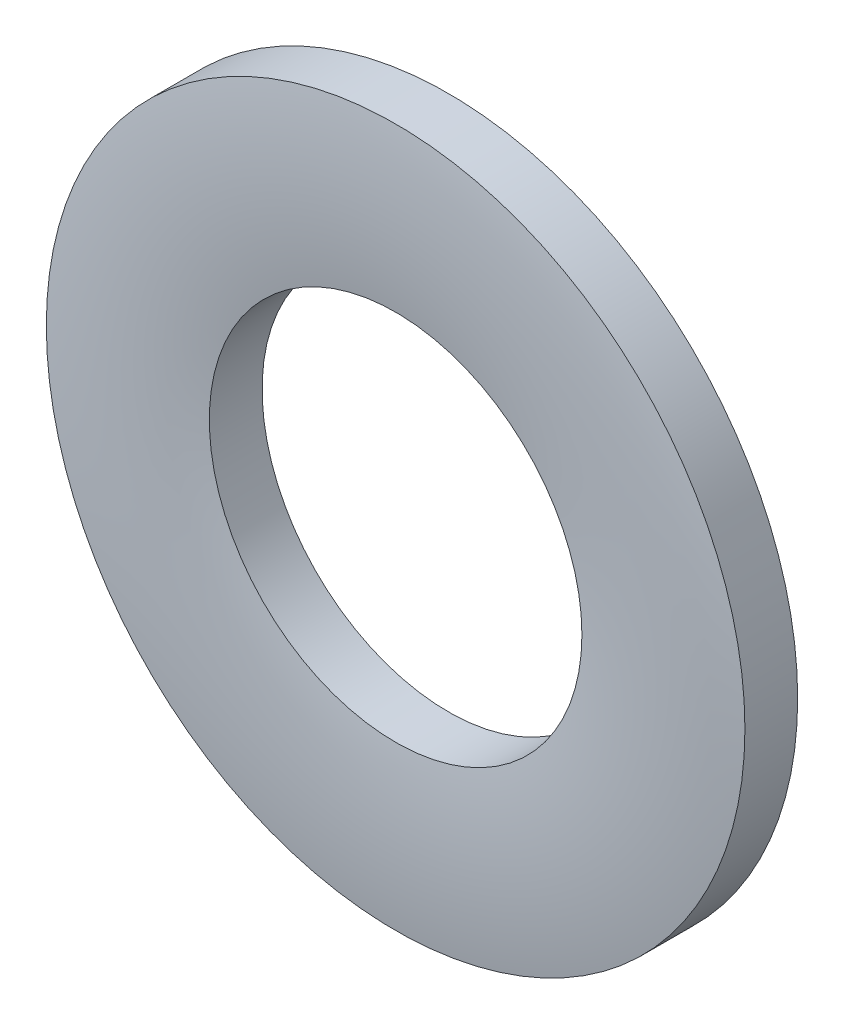
ISO-10303-21;
HEADER;
FILE_DESCRIPTION(('STEP AP214'),'2;1');
FILE_NAME('part.step','',(''),(''),'','','');
FILE_SCHEMA(('AUTOMOTIVE_DESIGN { 1 0 10303 214 1 1 1 1 }'));
ENDSEC;
DATA;
#1=APPLICATION_CONTEXT('core data for automotive mechanical design processes');
#2=APPLICATION_PROTOCOL_DEFINITION('international standard','automotive_design',2000,#1);
#3=PRODUCT_CONTEXT('',#1,'mechanical');
#4=PRODUCT('Part','Part','',(#3));
#5=PRODUCT_RELATED_PRODUCT_CATEGORY('part','',(#4));
#6=PRODUCT_DEFINITION_FORMATION('','',#4);
#7=PRODUCT_DEFINITION_CONTEXT('part definition',#1,'design');
#8=PRODUCT_DEFINITION('design','',#6,#7);
#9=PRODUCT_DEFINITION_SHAPE('','',#8);
#10=(LENGTH_UNIT() NAMED_UNIT(*) SI_UNIT(.MILLI.,.METRE.));
#11=(NAMED_UNIT(*) PLANE_ANGLE_UNIT() SI_UNIT($,.RADIAN.));
#12=(NAMED_UNIT(*) SI_UNIT($,.STERADIAN.) SOLID_ANGLE_UNIT());
#13=UNCERTAINTY_MEASURE_WITH_UNIT(LENGTH_MEASURE(1.E-05),#10,'distance_accuracy_value','');
#14=(GEOMETRIC_REPRESENTATION_CONTEXT(3) GLOBAL_UNCERTAINTY_ASSIGNED_CONTEXT((#13)) GLOBAL_UNIT_ASSIGNED_CONTEXT((#10,
#11,#12)) REPRESENTATION_CONTEXT('',''));
#15=CARTESIAN_POINT('',(0.,0.,0.));
#16=DIRECTION('',(0.,0.,1.));
#17=DIRECTION('',(1.,0.,0.));
#18=AXIS2_PLACEMENT_3D('',#15,#16,#17);
#19=CARTESIAN_POINT('',(0.,1.6,-0.25));
#20=DIRECTION('',(0.,0.,1.));
#21=DIRECTION('',(1.,0.,0.));
#22=AXIS2_PLACEMENT_3D('',#19,#20,#21);
#23=PLANE('',#22);
#24=CARTESIAN_POINT('',(0.,0.,-0.25));
#25=DIRECTION('',(0.,0.,1.));
#26=DIRECTION('',(1.,0.,0.));
#27=AXIS2_PLACEMENT_3D('',#24,#25,#26);
#28=CIRCLE('',#27,3.);
#29=CARTESIAN_POINT('',(3.,0.,-0.25));
#30=VERTEX_POINT('',#29);
#31=EDGE_CURVE('E60',#30,#30,#28,.T.);
#32=ORIENTED_EDGE('',*,*,#31,.F.);
#33=EDGE_LOOP('',(#32));
#34=FACE_BOUND('',#33,.T.);
#35=CARTESIAN_POINT('',(0.,0.,-0.25));
#36=DIRECTION('',(0.,0.,1.));
#37=DIRECTION('',(1.,0.,0.));
#38=AXIS2_PLACEMENT_3D('',#35,#36,#37);
#39=CIRCLE('',#38,1.6);
#40=CARTESIAN_POINT('',(1.6,0.,-0.25));
#41=VERTEX_POINT('',#40);
#42=EDGE_CURVE('E10',#41,#41,#39,.T.);
#43=ORIENTED_EDGE('',*,*,#42,.T.);
#44=EDGE_LOOP('',(#43));
#45=FACE_BOUND('',#44,.T.);
#46=ADVANCED_FACE('F42',(#34,#45),#23,.F.);
#47=CARTESIAN_POINT('',(0.,0.,0.25));
#48=DIRECTION('',(0.,0.,1.));
#49=DIRECTION('',(1.,0.,0.));
#50=AXIS2_PLACEMENT_3D('',#47,#48,#49);
#51=CYLINDRICAL_SURFACE('',#50,1.6);
#52=ORIENTED_EDGE('',*,*,#42,.F.);
#53=EDGE_LOOP('',(#52));
#54=FACE_BOUND('',#53,.T.);
#55=CARTESIAN_POINT('',(0.,0.,0.20315));
#56=DIRECTION('',(0.,0.,1.));
#57=DIRECTION('',(1.,0.,0.));
#58=AXIS2_PLACEMENT_3D('',#55,#56,#57);
#59=CIRCLE('',#58,1.6);
#60=CARTESIAN_POINT('',(1.6,0.,0.20315));
#61=VERTEX_POINT('',#60);
#62=EDGE_CURVE('E49',#61,#61,#59,.T.);
#63=ORIENTED_EDGE('',*,*,#62,.T.);
#64=EDGE_LOOP('',(#63));
#65=FACE_BOUND('',#64,.T.);
#66=ADVANCED_FACE('F69',(#54,#65),#51,.F.);
#67=CARTESIAN_POINT('',(0.,0.,-5.00288070971186));
#68=DIRECTION('',(0.,0.,1.));
#69=DIRECTION('',(1.,0.,0.));
#70=AXIS2_PLACEMENT_3D('',#67,#68,#69);
#71=DEGENERATE_TOROIDAL_SURFACE('',#70,2.3,5.25288070971186,.T.);
#72=ORIENTED_EDGE('',*,*,#62,.F.);
#73=EDGE_LOOP('',(#72));
#74=FACE_BOUND('',#73,.T.);
#75=CARTESIAN_POINT('',(0.,0.,0.20315));
#76=DIRECTION('',(0.,0.,1.));
#77=DIRECTION('',(1.,0.,0.));
#78=AXIS2_PLACEMENT_3D('',#75,#76,#77);
#79=CIRCLE('',#78,3.);
#80=CARTESIAN_POINT('',(3.,0.,0.20315));
#81=VERTEX_POINT('',#80);
#82=EDGE_CURVE('E54',#81,#81,#79,.T.);
#83=ORIENTED_EDGE('',*,*,#82,.T.);
#84=EDGE_LOOP('',(#83));
#85=FACE_BOUND('',#84,.T.);
#86=ADVANCED_FACE('F73',(#74,#85),#71,.T.);
#87=CARTESIAN_POINT('',(0.,0.,0.25));
#88=DIRECTION('',(0.,0.,1.));
#89=DIRECTION('',(1.,0.,0.));
#90=AXIS2_PLACEMENT_3D('',#87,#88,#89);
#91=CYLINDRICAL_SURFACE('',#90,3.);
#92=ORIENTED_EDGE('',*,*,#82,.F.);
#93=EDGE_LOOP('',(#92));
#94=FACE_BOUND('',#93,.T.);
#95=ORIENTED_EDGE('',*,*,#31,.T.);
#96=EDGE_LOOP('',(#95));
#97=FACE_BOUND('',#96,.T.);
#98=ADVANCED_FACE('F66',(#94,#97),#91,.T.);
#99=CLOSED_SHELL('',(#46,#66,#86,#98));
#100=MANIFOLD_SOLID_BREP('B2',#99);
#101=ADVANCED_BREP_SHAPE_REPRESENTATION('',(#18,#100),#14);
#102=SHAPE_DEFINITION_REPRESENTATION(#9,#101);
ENDSEC;
END-ISO-10303-21;
